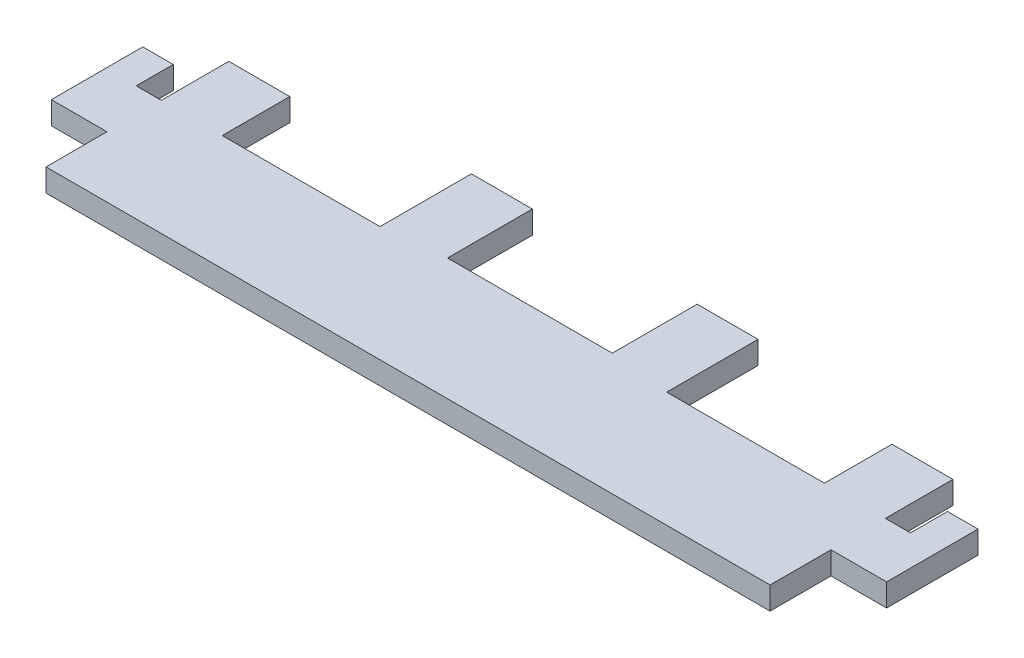
ISO-10303-21;
HEADER;
FILE_DESCRIPTION(('STEP AP214'),'2;1');
FILE_NAME('part.step','',(''),(''),'','','');
FILE_SCHEMA(('AUTOMOTIVE_DESIGN { 1 0 10303 214 1 1 1 1 }'));
ENDSEC;
DATA;
#1=APPLICATION_CONTEXT('core data for automotive mechanical design processes');
#2=APPLICATION_PROTOCOL_DEFINITION('international standard','automotive_design',2000,#1);
#3=PRODUCT_CONTEXT('',#1,'mechanical');
#4=PRODUCT('Part','Part','',(#3));
#5=PRODUCT_RELATED_PRODUCT_CATEGORY('part','',(#4));
#6=PRODUCT_DEFINITION_FORMATION('','',#4);
#7=PRODUCT_DEFINITION_CONTEXT('part definition',#1,'design');
#8=PRODUCT_DEFINITION('design','',#6,#7);
#9=PRODUCT_DEFINITION_SHAPE('','',#8);
#10=(LENGTH_UNIT() NAMED_UNIT(*) SI_UNIT(.MILLI.,.METRE.));
#11=(NAMED_UNIT(*) PLANE_ANGLE_UNIT() SI_UNIT($,.RADIAN.));
#12=(NAMED_UNIT(*) SI_UNIT($,.STERADIAN.) SOLID_ANGLE_UNIT());
#13=UNCERTAINTY_MEASURE_WITH_UNIT(LENGTH_MEASURE(1.E-05),#10,'distance_accuracy_value','');
#14=(GEOMETRIC_REPRESENTATION_CONTEXT(3) GLOBAL_UNCERTAINTY_ASSIGNED_CONTEXT((#13)) GLOBAL_UNIT_ASSIGNED_CONTEXT((#10,
#11,#12)) REPRESENTATION_CONTEXT('',''));
#15=CARTESIAN_POINT('',(0.,0.,0.));
#16=DIRECTION('',(0.,0.,1.));
#17=DIRECTION('',(1.,0.,0.));
#18=AXIS2_PLACEMENT_3D('',#15,#16,#17);
#19=CARTESIAN_POINT('',(-75.438,2.3622,-19.05));
#20=DIRECTION('',(1.,0.,0.));
#21=DIRECTION('',(0.,0.,-1.));
#22=AXIS2_PLACEMENT_3D('',#19,#20,#21);
#23=PLANE('',#22);
#24=DIRECTION('',(0.,0.,1.));
#25=VECTOR('',#24,1.);
#26=CARTESIAN_POINT('',(-75.438,0.,-19.05));
#27=LINE('',#26,#25);
#28=CARTESIAN_POINT('',(-75.438,0.,-19.05));
#29=VERTEX_POINT('',#28);
#30=CARTESIAN_POINT('',(-75.438,0.,-12.0142));
#31=VERTEX_POINT('',#30);
#32=EDGE_CURVE('E286',#29,#31,#27,.T.);
#33=ORIENTED_EDGE('',*,*,#32,.T.);
#34=DIRECTION('',(0.,-1.,0.));
#35=VECTOR('',#34,1.);
#36=CARTESIAN_POINT('',(-75.438,2.3622,-12.0142));
#37=LINE('',#36,#35);
#38=CARTESIAN_POINT('',(-75.438,2.3622,-12.0142));
#39=VERTEX_POINT('',#38);
#40=EDGE_CURVE('E408',#39,#31,#37,.T.);
#41=ORIENTED_EDGE('',*,*,#40,.F.);
#42=DIRECTION('',(0.,0.,1.));
#43=VECTOR('',#42,1.);
#44=CARTESIAN_POINT('',(-75.438,2.3622,-19.05));
#45=LINE('',#44,#43);
#46=CARTESIAN_POINT('',(-75.438,2.3622,-19.05));
#47=VERTEX_POINT('',#46);
#48=EDGE_CURVE('E341',#47,#39,#45,.T.);
#49=ORIENTED_EDGE('',*,*,#48,.F.);
#50=DIRECTION('',(0.,-1.,0.));
#51=VECTOR('',#50,1.);
#52=CARTESIAN_POINT('',(-75.438,2.3622,-19.05));
#53=LINE('',#52,#51);
#54=EDGE_CURVE('E285',#47,#29,#53,.T.);
#55=ORIENTED_EDGE('',*,*,#54,.T.);
#56=EDGE_LOOP('',(#33,#41,#49,#55));
#57=FACE_BOUND('',#56,.T.);
#58=ADVANCED_FACE('F34',(#57),#23,.F.);
#59=CARTESIAN_POINT('',(-75.438,2.3622,-12.0142));
#60=DIRECTION('',(0.,0.,1.));
#61=DIRECTION('',(1.,0.,0.));
#62=AXIS2_PLACEMENT_3D('',#59,#60,#61);
#63=PLANE('',#62);
#64=DIRECTION('',(-1.,0.,0.));
#65=VECTOR('',#64,1.);
#66=CARTESIAN_POINT('',(-75.438,0.,-12.0142));
#67=LINE('',#66,#65);
#68=CARTESIAN_POINT('',(-78.0542,0.,-12.0142));
#69=VERTEX_POINT('',#68);
#70=EDGE_CURVE('E289',#31,#69,#67,.T.);
#71=ORIENTED_EDGE('',*,*,#70,.T.);
#72=DIRECTION('',(0.,-1.,0.));
#73=VECTOR('',#72,1.);
#74=CARTESIAN_POINT('',(-78.0542,2.3622,-12.0142));
#75=LINE('',#74,#73);
#76=CARTESIAN_POINT('',(-78.0542,2.3622,-12.0142));
#77=VERTEX_POINT('',#76);
#78=EDGE_CURVE('E405',#77,#69,#75,.T.);
#79=ORIENTED_EDGE('',*,*,#78,.F.);
#80=DIRECTION('',(-1.,0.,0.));
#81=VECTOR('',#80,1.);
#82=CARTESIAN_POINT('',(-75.438,2.3622,-12.0142));
#83=LINE('',#82,#81);
#84=EDGE_CURVE('E239',#39,#77,#83,.T.);
#85=ORIENTED_EDGE('',*,*,#84,.F.);
#86=ORIENTED_EDGE('',*,*,#40,.T.);
#87=EDGE_LOOP('',(#71,#79,#85,#86));
#88=FACE_BOUND('',#87,.T.);
#89=ADVANCED_FACE('F447',(#88),#63,.F.);
#90=CARTESIAN_POINT('',(-78.0542,2.3622,-19.05));
#91=DIRECTION('',(-1.,0.,0.));
#92=DIRECTION('',(0.,0.,1.));
#93=AXIS2_PLACEMENT_3D('',#90,#91,#92);
#94=PLANE('',#93);
#95=DIRECTION('',(0.,0.,-1.));
#96=VECTOR('',#95,1.);
#97=CARTESIAN_POINT('',(-78.0542,0.,-19.05));
#98=LINE('',#97,#96);
#99=CARTESIAN_POINT('',(-78.0542,0.,-15.875));
#100=VERTEX_POINT('',#99);
#101=EDGE_CURVE('E291',#69,#100,#98,.T.);
#102=ORIENTED_EDGE('',*,*,#101,.T.);
#103=DIRECTION('',(0.,1.,0.));
#104=VECTOR('',#103,1.);
#105=CARTESIAN_POINT('',(-78.0542,-0.1778,-15.875));
#106=LINE('',#105,#104);
#107=CARTESIAN_POINT('',(-78.0542,2.3622,-15.875));
#108=VERTEX_POINT('',#107);
#109=EDGE_CURVE('E47',#100,#108,#106,.T.);
#110=ORIENTED_EDGE('',*,*,#109,.T.);
#111=DIRECTION('',(0.,0.,-1.));
#112=VECTOR('',#111,1.);
#113=CARTESIAN_POINT('',(-78.0542,2.3622,-19.05));
#114=LINE('',#113,#112);
#115=EDGE_CURVE('E229',#77,#108,#114,.T.);
#116=ORIENTED_EDGE('',*,*,#115,.F.);
#117=ORIENTED_EDGE('',*,*,#78,.T.);
#118=EDGE_LOOP('',(#102,#110,#116,#117));
#119=FACE_BOUND('',#118,.T.);
#120=ADVANCED_FACE('F450',(#119),#94,.F.);
#121=CARTESIAN_POINT('',(-81.2292,2.3622,-6.34999999999999));
#122=DIRECTION('',(1.,0.,0.));
#123=DIRECTION('',(0.,0.,-1.));
#124=AXIS2_PLACEMENT_3D('',#121,#122,#123);
#125=PLANE('',#124);
#126=DIRECTION('',(0.,0.,1.));
#127=VECTOR('',#126,1.);
#128=CARTESIAN_POINT('',(-81.2292,2.3622,-6.34999999999999));
#129=LINE('',#128,#127);
#130=CARTESIAN_POINT('',(-81.2292,2.3622,-15.875));
#131=VERTEX_POINT('',#130);
#132=CARTESIAN_POINT('',(-81.2292,2.3622,-6.34999999999999));
#133=VERTEX_POINT('',#132);
#134=EDGE_CURVE('E226',#131,#133,#129,.T.);
#135=ORIENTED_EDGE('',*,*,#134,.F.);
#136=DIRECTION('',(0.,1.,0.));
#137=VECTOR('',#136,1.);
#138=CARTESIAN_POINT('',(-81.2292,-0.1778,-15.875));
#139=LINE('',#138,#137);
#140=CARTESIAN_POINT('',(-81.2292,0.,-15.875));
#141=VERTEX_POINT('',#140);
#142=EDGE_CURVE('E215',#141,#131,#139,.T.);
#143=ORIENTED_EDGE('',*,*,#142,.F.);
#144=DIRECTION('',(0.,0.,1.));
#145=VECTOR('',#144,1.);
#146=CARTESIAN_POINT('',(-81.2292,0.,-6.34999999999999));
#147=LINE('',#146,#145);
#148=CARTESIAN_POINT('',(-81.2292,0.,-6.34999999999999));
#149=VERTEX_POINT('',#148);
#150=EDGE_CURVE('E294',#141,#149,#147,.T.);
#151=ORIENTED_EDGE('',*,*,#150,.T.);
#152=DIRECTION('',(0.,-1.,0.));
#153=VECTOR('',#152,1.);
#154=CARTESIAN_POINT('',(-81.2292,2.3622,-6.34999999999999));
#155=LINE('',#154,#153);
#156=EDGE_CURVE('E233',#133,#149,#155,.T.);
#157=ORIENTED_EDGE('',*,*,#156,.F.);
#158=EDGE_LOOP('',(#135,#143,#151,#157));
#159=FACE_BOUND('',#158,.T.);
#160=ADVANCED_FACE('F231',(#159),#125,.F.);
#161=CARTESIAN_POINT('',(-81.2292,2.3622,-6.34999999999999));
#162=DIRECTION('',(0.,0.,-1.));
#163=DIRECTION('',(-1.,0.,0.));
#164=AXIS2_PLACEMENT_3D('',#161,#162,#163);
#165=PLANE('',#164);
#166=DIRECTION('',(1.,0.,0.));
#167=VECTOR('',#166,1.);
#168=CARTESIAN_POINT('',(-81.2292,0.,-6.34999999999999));
#169=LINE('',#168,#167);
#170=CARTESIAN_POINT('',(-75.438,0.,-6.34999999999999));
#171=VERTEX_POINT('',#170);
#172=EDGE_CURVE('E296',#149,#171,#169,.T.);
#173=ORIENTED_EDGE('',*,*,#172,.T.);
#174=DIRECTION('',(0.,-1.,0.));
#175=VECTOR('',#174,1.);
#176=CARTESIAN_POINT('',(-75.438,2.3622,-6.34999999999999));
#177=LINE('',#176,#175);
#178=CARTESIAN_POINT('',(-75.438,2.3622,-6.34999999999999));
#179=VERTEX_POINT('',#178);
#180=EDGE_CURVE('E401',#179,#171,#177,.T.);
#181=ORIENTED_EDGE('',*,*,#180,.F.);
#182=DIRECTION('',(1.,0.,0.));
#183=VECTOR('',#182,1.);
#184=CARTESIAN_POINT('',(-81.2292,2.3622,-6.34999999999999));
#185=LINE('',#184,#183);
#186=EDGE_CURVE('E235',#133,#179,#185,.T.);
#187=ORIENTED_EDGE('',*,*,#186,.F.);
#188=ORIENTED_EDGE('',*,*,#156,.T.);
#189=EDGE_LOOP('',(#173,#181,#187,#188));
#190=FACE_BOUND('',#189,.T.);
#191=ADVANCED_FACE('F455',(#190),#165,.F.);
#192=CARTESIAN_POINT('',(-75.438,2.3622,-6.34999999999999));
#193=DIRECTION('',(1.,0.,0.));
#194=DIRECTION('',(0.,0.,-1.));
#195=AXIS2_PLACEMENT_3D('',#192,#193,#194);
#196=PLANE('',#195);
#197=DIRECTION('',(0.,0.,1.));
#198=VECTOR('',#197,1.);
#199=CARTESIAN_POINT('',(-75.438,0.,-6.34999999999999));
#200=LINE('',#199,#198);
#201=CARTESIAN_POINT('',(-75.438,0.,0.));
#202=VERTEX_POINT('',#201);
#203=EDGE_CURVE('E298',#171,#202,#200,.T.);
#204=ORIENTED_EDGE('',*,*,#203,.T.);
#205=DIRECTION('',(0.,-1.,0.));
#206=VECTOR('',#205,1.);
#207=CARTESIAN_POINT('',(-75.438,2.3622,0.));
#208=LINE('',#207,#206);
#209=CARTESIAN_POINT('',(-75.438,2.3622,0.));
#210=VERTEX_POINT('',#209);
#211=EDGE_CURVE('E398',#210,#202,#208,.T.);
#212=ORIENTED_EDGE('',*,*,#211,.F.);
#213=DIRECTION('',(0.,0.,1.));
#214=VECTOR('',#213,1.);
#215=CARTESIAN_POINT('',(-75.438,2.3622,-6.34999999999999));
#216=LINE('',#215,#214);
#217=EDGE_CURVE('E237',#179,#210,#216,.T.);
#218=ORIENTED_EDGE('',*,*,#217,.F.);
#219=ORIENTED_EDGE('',*,*,#180,.T.);
#220=EDGE_LOOP('',(#204,#212,#218,#219));
#221=FACE_BOUND('',#220,.T.);
#222=ADVANCED_FACE('F462',(#221),#196,.F.);
#223=CARTESIAN_POINT('',(0.,2.3622,0.));
#224=DIRECTION('',(0.,0.,-1.));
#225=DIRECTION('',(-1.,0.,0.));
#226=AXIS2_PLACEMENT_3D('',#223,#224,#225);
#227=PLANE('',#226);
#228=DIRECTION('',(1.,0.,0.));
#229=VECTOR('',#228,1.);
#230=CARTESIAN_POINT('',(0.,0.,0.));
#231=LINE('',#230,#229);
#232=CARTESIAN_POINT('',(0.,0.,0.));
#233=VERTEX_POINT('',#232);
#234=EDGE_CURVE('E300',#202,#233,#231,.T.);
#235=ORIENTED_EDGE('',*,*,#234,.T.);
#236=DIRECTION('',(0.,-1.,0.));
#237=VECTOR('',#236,1.);
#238=CARTESIAN_POINT('',(0.,2.3622,0.));
#239=LINE('',#238,#237);
#240=CARTESIAN_POINT('',(0.,2.3622,0.));
#241=VERTEX_POINT('',#240);
#242=EDGE_CURVE('E395',#241,#233,#239,.T.);
#243=ORIENTED_EDGE('',*,*,#242,.F.);
#244=DIRECTION('',(1.,0.,0.));
#245=VECTOR('',#244,1.);
#246=CARTESIAN_POINT('',(0.,2.3622,0.));
#247=LINE('',#246,#245);
#248=EDGE_CURVE('E244',#210,#241,#247,.T.);
#249=ORIENTED_EDGE('',*,*,#248,.F.);
#250=ORIENTED_EDGE('',*,*,#211,.T.);
#251=EDGE_LOOP('',(#235,#243,#249,#250));
#252=FACE_BOUND('',#251,.T.);
#253=ADVANCED_FACE('F465',(#252),#227,.F.);
#254=CARTESIAN_POINT('',(0.,2.3622,-6.35));
#255=DIRECTION('',(-1.,0.,0.));
#256=DIRECTION('',(0.,0.,1.));
#257=AXIS2_PLACEMENT_3D('',#254,#255,#256);
#258=PLANE('',#257);
#259=DIRECTION('',(0.,0.,-1.));
#260=VECTOR('',#259,1.);
#261=CARTESIAN_POINT('',(0.,0.,-6.35));
#262=LINE('',#261,#260);
#263=CARTESIAN_POINT('',(0.,0.,-6.35));
#264=VERTEX_POINT('',#263);
#265=EDGE_CURVE('E302',#233,#264,#262,.T.);
#266=ORIENTED_EDGE('',*,*,#265,.T.);
#267=DIRECTION('',(0.,-1.,0.));
#268=VECTOR('',#267,1.);
#269=CARTESIAN_POINT('',(0.,2.3622,-6.35));
#270=LINE('',#269,#268);
#271=CARTESIAN_POINT('',(0.,2.3622,-6.35));
#272=VERTEX_POINT('',#271);
#273=EDGE_CURVE('E392',#272,#264,#270,.T.);
#274=ORIENTED_EDGE('',*,*,#273,.F.);
#275=DIRECTION('',(0.,0.,-1.));
#276=VECTOR('',#275,1.);
#277=CARTESIAN_POINT('',(0.,2.3622,-6.35));
#278=LINE('',#277,#276);
#279=EDGE_CURVE('E246',#241,#272,#278,.T.);
#280=ORIENTED_EDGE('',*,*,#279,.F.);
#281=ORIENTED_EDGE('',*,*,#242,.T.);
#282=EDGE_LOOP('',(#266,#274,#280,#281));
#283=FACE_BOUND('',#282,.T.);
#284=ADVANCED_FACE('F470',(#283),#258,.F.);
#285=CARTESIAN_POINT('',(5.7912,2.3622,-6.34999999999999));
#286=DIRECTION('',(0.,0.,-1.));
#287=DIRECTION('',(-1.,0.,0.));
#288=AXIS2_PLACEMENT_3D('',#285,#286,#287);
#289=PLANE('',#288);
#290=DIRECTION('',(1.,0.,0.));
#291=VECTOR('',#290,1.);
#292=CARTESIAN_POINT('',(5.7912,0.,-6.34999999999999));
#293=LINE('',#292,#291);
#294=CARTESIAN_POINT('',(5.7912,0.,-6.34999999999999));
#295=VERTEX_POINT('',#294);
#296=EDGE_CURVE('E304',#264,#295,#293,.T.);
#297=ORIENTED_EDGE('',*,*,#296,.T.);
#298=DIRECTION('',(0.,-1.,0.));
#299=VECTOR('',#298,1.);
#300=CARTESIAN_POINT('',(5.7912,2.3622,-6.34999999999999));
#301=LINE('',#300,#299);
#302=CARTESIAN_POINT('',(5.7912,2.3622,-6.34999999999999));
#303=VERTEX_POINT('',#302);
#304=EDGE_CURVE('E389',#303,#295,#301,.T.);
#305=ORIENTED_EDGE('',*,*,#304,.F.);
#306=DIRECTION('',(1.,0.,0.));
#307=VECTOR('',#306,1.);
#308=CARTESIAN_POINT('',(5.7912,2.3622,-6.34999999999999));
#309=LINE('',#308,#307);
#310=EDGE_CURVE('E248',#272,#303,#309,.T.);
#311=ORIENTED_EDGE('',*,*,#310,.F.);
#312=ORIENTED_EDGE('',*,*,#273,.T.);
#313=EDGE_LOOP('',(#297,#305,#311,#312));
#314=FACE_BOUND('',#313,.T.);
#315=ADVANCED_FACE('F474',(#314),#289,.F.);
#316=CARTESIAN_POINT('',(5.7912,2.3622,-6.34999999999999));
#317=DIRECTION('',(-1.,0.,0.));
#318=DIRECTION('',(0.,0.,1.));
#319=AXIS2_PLACEMENT_3D('',#316,#317,#318);
#320=PLANE('',#319);
#321=DIRECTION('',(0.,0.,-1.));
#322=VECTOR('',#321,1.);
#323=CARTESIAN_POINT('',(5.7912,0.,-6.34999999999999));
#324=LINE('',#323,#322);
#325=CARTESIAN_POINT('',(5.7912,0.,-15.875));
#326=VERTEX_POINT('',#325);
#327=EDGE_CURVE('E306',#295,#326,#324,.T.);
#328=ORIENTED_EDGE('',*,*,#327,.T.);
#329=DIRECTION('',(0.,1.,0.));
#330=VECTOR('',#329,1.);
#331=CARTESIAN_POINT('',(5.7912,-0.1778,-15.875));
#332=LINE('',#331,#330);
#333=CARTESIAN_POINT('',(5.7912,2.3622,-15.875));
#334=VERTEX_POINT('',#333);
#335=EDGE_CURVE('E55',#326,#334,#332,.T.);
#336=ORIENTED_EDGE('',*,*,#335,.T.);
#337=DIRECTION('',(0.,0.,-1.));
#338=VECTOR('',#337,1.);
#339=CARTESIAN_POINT('',(5.7912,2.3622,-6.34999999999999));
#340=LINE('',#339,#338);
#341=EDGE_CURVE('E250',#303,#334,#340,.T.);
#342=ORIENTED_EDGE('',*,*,#341,.F.);
#343=ORIENTED_EDGE('',*,*,#304,.T.);
#344=EDGE_LOOP('',(#328,#336,#342,#343));
#345=FACE_BOUND('',#344,.T.);
#346=ADVANCED_FACE('F477',(#345),#320,.F.);
#347=CARTESIAN_POINT('',(2.6162,2.3622,-19.05));
#348=DIRECTION('',(1.,0.,0.));
#349=DIRECTION('',(0.,0.,-1.));
#350=AXIS2_PLACEMENT_3D('',#347,#348,#349);
#351=PLANE('',#350);
#352=DIRECTION('',(0.,0.,1.));
#353=VECTOR('',#352,1.);
#354=CARTESIAN_POINT('',(2.6162,2.3622,-19.05));
#355=LINE('',#354,#353);
#356=CARTESIAN_POINT('',(2.6162,2.3622,-15.875));
#357=VERTEX_POINT('',#356);
#358=CARTESIAN_POINT('',(2.6162,2.3622,-12.0142));
#359=VERTEX_POINT('',#358);
#360=EDGE_CURVE('E253',#357,#359,#355,.T.);
#361=ORIENTED_EDGE('',*,*,#360,.F.);
#362=DIRECTION('',(0.,1.,0.));
#363=VECTOR('',#362,1.);
#364=CARTESIAN_POINT('',(2.6162,-0.1778,-15.875));
#365=LINE('',#364,#363);
#366=CARTESIAN_POINT('',(2.6162,0.,-15.875));
#367=VERTEX_POINT('',#366);
#368=EDGE_CURVE('E412',#367,#357,#365,.T.);
#369=ORIENTED_EDGE('',*,*,#368,.F.);
#370=DIRECTION('',(0.,0.,1.));
#371=VECTOR('',#370,1.);
#372=CARTESIAN_POINT('',(2.6162,0.,-19.05));
#373=LINE('',#372,#371);
#374=CARTESIAN_POINT('',(2.6162,0.,-12.0142));
#375=VERTEX_POINT('',#374);
#376=EDGE_CURVE('E309',#367,#375,#373,.T.);
#377=ORIENTED_EDGE('',*,*,#376,.T.);
#378=DIRECTION('',(0.,-1.,0.));
#379=VECTOR('',#378,1.);
#380=CARTESIAN_POINT('',(2.6162,2.3622,-12.0142));
#381=LINE('',#380,#379);
#382=EDGE_CURVE('E386',#359,#375,#381,.T.);
#383=ORIENTED_EDGE('',*,*,#382,.F.);
#384=EDGE_LOOP('',(#361,#369,#377,#383));
#385=FACE_BOUND('',#384,.T.);
#386=ADVANCED_FACE('F419',(#385),#351,.F.);
#387=CARTESIAN_POINT('',(0.,2.3622,-12.0142));
#388=DIRECTION('',(0.,0.,1.));
#389=DIRECTION('',(1.,0.,0.));
#390=AXIS2_PLACEMENT_3D('',#387,#388,#389);
#391=PLANE('',#390);
#392=DIRECTION('',(-1.,0.,0.));
#393=VECTOR('',#392,1.);
#394=CARTESIAN_POINT('',(0.,0.,-12.0142));
#395=LINE('',#394,#393);
#396=CARTESIAN_POINT('',(0.,0.,-12.0142));
#397=VERTEX_POINT('',#396);
#398=EDGE_CURVE('E311',#375,#397,#395,.T.);
#399=ORIENTED_EDGE('',*,*,#398,.T.);
#400=DIRECTION('',(0.,-1.,0.));
#401=VECTOR('',#400,1.);
#402=CARTESIAN_POINT('',(0.,2.3622,-12.0142));
#403=LINE('',#402,#401);
#404=CARTESIAN_POINT('',(0.,2.3622,-12.0142));
#405=VERTEX_POINT('',#404);
#406=EDGE_CURVE('E383',#405,#397,#403,.T.);
#407=ORIENTED_EDGE('',*,*,#406,.F.);
#408=DIRECTION('',(-1.,0.,0.));
#409=VECTOR('',#408,1.);
#410=CARTESIAN_POINT('',(0.,2.3622,-12.0142));
#411=LINE('',#410,#409);
#412=EDGE_CURVE('E255',#359,#405,#411,.T.);
#413=ORIENTED_EDGE('',*,*,#412,.F.);
#414=ORIENTED_EDGE('',*,*,#382,.T.);
#415=EDGE_LOOP('',(#399,#407,#413,#414));
#416=FACE_BOUND('',#415,.T.);
#417=ADVANCED_FACE('F429',(#416),#391,.F.);
#418=CARTESIAN_POINT('',(0.,2.3622,-19.05));
#419=DIRECTION('',(-1.,0.,0.));
#420=DIRECTION('',(0.,0.,1.));
#421=AXIS2_PLACEMENT_3D('',#418,#419,#420);
#422=PLANE('',#421);
#423=DIRECTION('',(0.,0.,-1.));
#424=VECTOR('',#423,1.);
#425=CARTESIAN_POINT('',(0.,0.,-19.05));
#426=LINE('',#425,#424);
#427=CARTESIAN_POINT('',(0.,0.,-19.05));
#428=VERTEX_POINT('',#427);
#429=EDGE_CURVE('E313',#397,#428,#426,.T.);
#430=ORIENTED_EDGE('',*,*,#429,.T.);
#431=DIRECTION('',(0.,-1.,0.));
#432=VECTOR('',#431,1.);
#433=CARTESIAN_POINT('',(0.,2.3622,-19.05));
#434=LINE('',#433,#432);
#435=CARTESIAN_POINT('',(0.,2.3622,-19.05));
#436=VERTEX_POINT('',#435);
#437=EDGE_CURVE('E380',#436,#428,#434,.T.);
#438=ORIENTED_EDGE('',*,*,#437,.F.);
#439=DIRECTION('',(0.,0.,-1.));
#440=VECTOR('',#439,1.);
#441=CARTESIAN_POINT('',(0.,2.3622,-19.05));
#442=LINE('',#441,#440);
#443=EDGE_CURVE('E257',#405,#436,#442,.T.);
#444=ORIENTED_EDGE('',*,*,#443,.F.);
#445=ORIENTED_EDGE('',*,*,#406,.T.);
#446=EDGE_LOOP('',(#430,#438,#444,#445));
#447=FACE_BOUND('',#446,.T.);
#448=ADVANCED_FACE('F433',(#447),#422,.F.);
#449=CARTESIAN_POINT('',(-6.35,2.3622,-19.05));
#450=DIRECTION('',(0.,0.,1.));
#451=DIRECTION('',(1.,0.,0.));
#452=AXIS2_PLACEMENT_3D('',#449,#450,#451);
#453=PLANE('',#452);
#454=DIRECTION('',(-1.,0.,0.));
#455=VECTOR('',#454,1.);
#456=CARTESIAN_POINT('',(-6.35,0.,-19.05));
#457=LINE('',#456,#455);
#458=CARTESIAN_POINT('',(-6.35,0.,-19.05));
#459=VERTEX_POINT('',#458);
#460=EDGE_CURVE('E315',#428,#459,#457,.T.);
#461=ORIENTED_EDGE('',*,*,#460,.T.);
#462=DIRECTION('',(0.,-1.,0.));
#463=VECTOR('',#462,1.);
#464=CARTESIAN_POINT('',(-6.35,2.3622,-19.05));
#465=LINE('',#464,#463);
#466=CARTESIAN_POINT('',(-6.35,2.3622,-19.05));
#467=VERTEX_POINT('',#466);
#468=EDGE_CURVE('E377',#467,#459,#465,.T.);
#469=ORIENTED_EDGE('',*,*,#468,.F.);
#470=DIRECTION('',(-1.,0.,0.));
#471=VECTOR('',#470,1.);
#472=CARTESIAN_POINT('',(-6.35,2.3622,-19.05));
#473=LINE('',#472,#471);
#474=EDGE_CURVE('E259',#436,#467,#473,.T.);
#475=ORIENTED_EDGE('',*,*,#474,.F.);
#476=ORIENTED_EDGE('',*,*,#437,.T.);
#477=EDGE_LOOP('',(#461,#469,#475,#476));
#478=FACE_BOUND('',#477,.T.);
#479=ADVANCED_FACE('F553',(#478),#453,.F.);
#480=CARTESIAN_POINT('',(-6.35,2.3622,-12.0142));
#481=DIRECTION('',(1.,0.,0.));
#482=DIRECTION('',(0.,0.,-1.));
#483=AXIS2_PLACEMENT_3D('',#480,#481,#482);
#484=PLANE('',#483);
#485=DIRECTION('',(0.,0.,1.));
#486=VECTOR('',#485,1.);
#487=CARTESIAN_POINT('',(-6.35,0.,-12.0142));
#488=LINE('',#487,#486);
#489=CARTESIAN_POINT('',(-6.35,0.,-12.0142));
#490=VERTEX_POINT('',#489);
#491=EDGE_CURVE('E317',#459,#490,#488,.T.);
#492=ORIENTED_EDGE('',*,*,#491,.T.);
#493=DIRECTION('',(0.,-1.,0.));
#494=VECTOR('',#493,1.);
#495=CARTESIAN_POINT('',(-6.35,2.3622,-12.0142));
#496=LINE('',#495,#494);
#497=CARTESIAN_POINT('',(-6.35,2.3622,-12.0142));
#498=VERTEX_POINT('',#497);
#499=EDGE_CURVE('E374',#498,#490,#496,.T.);
#500=ORIENTED_EDGE('',*,*,#499,.F.);
#501=DIRECTION('',(0.,0.,1.));
#502=VECTOR('',#501,1.);
#503=CARTESIAN_POINT('',(-6.35,2.3622,-12.0142));
#504=LINE('',#503,#502);
#505=EDGE_CURVE('E261',#467,#498,#504,.T.);
#506=ORIENTED_EDGE('',*,*,#505,.F.);
#507=ORIENTED_EDGE('',*,*,#468,.T.);
#508=EDGE_LOOP('',(#492,#500,#506,#507));
#509=FACE_BOUND('',#508,.T.);
#510=ADVANCED_FACE('F551',(#509),#484,.F.);
#511=CARTESIAN_POINT('',(-22.7838,2.3622,-12.0142));
#512=DIRECTION('',(0.,0.,1.));
#513=DIRECTION('',(1.,0.,0.));
#514=AXIS2_PLACEMENT_3D('',#511,#512,#513);
#515=PLANE('',#514);
#516=DIRECTION('',(-1.,0.,0.));
#517=VECTOR('',#516,1.);
#518=CARTESIAN_POINT('',(-22.7838,0.,-12.0142));
#519=LINE('',#518,#517);
#520=CARTESIAN_POINT('',(-22.7838,0.,-12.0142));
#521=VERTEX_POINT('',#520);
#522=EDGE_CURVE('E319',#490,#521,#519,.T.);
#523=ORIENTED_EDGE('',*,*,#522,.T.);
#524=DIRECTION('',(0.,-1.,0.));
#525=VECTOR('',#524,1.);
#526=CARTESIAN_POINT('',(-22.7838,2.3622,-12.0142));
#527=LINE('',#526,#525);
#528=CARTESIAN_POINT('',(-22.7838,2.3622,-12.0142));
#529=VERTEX_POINT('',#528);
#530=EDGE_CURVE('E371',#529,#521,#527,.T.);
#531=ORIENTED_EDGE('',*,*,#530,.F.);
#532=DIRECTION('',(-1.,0.,0.));
#533=VECTOR('',#532,1.);
#534=CARTESIAN_POINT('',(-22.7838,2.3622,-12.0142));
#535=LINE('',#534,#533);
#536=EDGE_CURVE('E263',#498,#529,#535,.T.);
#537=ORIENTED_EDGE('',*,*,#536,.F.);
#538=ORIENTED_EDGE('',*,*,#499,.T.);
#539=EDGE_LOOP('',(#523,#531,#537,#538));
#540=FACE_BOUND('',#539,.T.);
#541=ADVANCED_FACE('F547',(#540),#515,.F.);
#542=CARTESIAN_POINT('',(-22.7838,2.3622,-12.0142));
#543=DIRECTION('',(-1.,0.,0.));
#544=DIRECTION('',(0.,0.,1.));
#545=AXIS2_PLACEMENT_3D('',#542,#543,#544);
#546=PLANE('',#545);
#547=DIRECTION('',(0.,0.,-1.));
#548=VECTOR('',#547,1.);
#549=CARTESIAN_POINT('',(-22.7838,0.,-12.0142));
#550=LINE('',#549,#548);
#551=CARTESIAN_POINT('',(-22.7838,0.,-21.5392));
#552=VERTEX_POINT('',#551);
#553=EDGE_CURVE('E321',#521,#552,#550,.T.);
#554=ORIENTED_EDGE('',*,*,#553,.T.);
#555=DIRECTION('',(0.,-1.,0.));
#556=VECTOR('',#555,1.);
#557=CARTESIAN_POINT('',(-22.7838,2.3622,-21.5392));
#558=LINE('',#557,#556);
#559=CARTESIAN_POINT('',(-22.7838,2.3622,-21.5392));
#560=VERTEX_POINT('',#559);
#561=EDGE_CURVE('E368',#560,#552,#558,.T.);
#562=ORIENTED_EDGE('',*,*,#561,.F.);
#563=DIRECTION('',(0.,0.,-1.));
#564=VECTOR('',#563,1.);
#565=CARTESIAN_POINT('',(-22.7838,2.3622,-12.0142));
#566=LINE('',#565,#564);
#567=EDGE_CURVE('E265',#529,#560,#566,.T.);
#568=ORIENTED_EDGE('',*,*,#567,.F.);
#569=ORIENTED_EDGE('',*,*,#530,.T.);
#570=EDGE_LOOP('',(#554,#562,#568,#569));
#571=FACE_BOUND('',#570,.T.);
#572=ADVANCED_FACE('F542',(#571),#546,.F.);
#573=CARTESIAN_POINT('',(-22.7838,2.3622,-21.5392));
#574=DIRECTION('',(0.,0.,1.));
#575=DIRECTION('',(1.,0.,0.));
#576=AXIS2_PLACEMENT_3D('',#573,#574,#575);
#577=PLANE('',#576);
#578=DIRECTION('',(-1.,0.,0.));
#579=VECTOR('',#578,1.);
#580=CARTESIAN_POINT('',(-22.7838,0.,-21.5392));
#581=LINE('',#580,#579);
#582=CARTESIAN_POINT('',(-29.1338,0.,-21.5392));
#583=VERTEX_POINT('',#582);
#584=EDGE_CURVE('E323',#552,#583,#581,.T.);
#585=ORIENTED_EDGE('',*,*,#584,.T.);
#586=DIRECTION('',(0.,-1.,0.));
#587=VECTOR('',#586,1.);
#588=CARTESIAN_POINT('',(-29.1338,2.3622,-21.5392));
#589=LINE('',#588,#587);
#590=CARTESIAN_POINT('',(-29.1338,2.3622,-21.5392));
#591=VERTEX_POINT('',#590);
#592=EDGE_CURVE('E365',#591,#583,#589,.T.);
#593=ORIENTED_EDGE('',*,*,#592,.F.);
#594=DIRECTION('',(-1.,0.,0.));
#595=VECTOR('',#594,1.);
#596=CARTESIAN_POINT('',(-22.7838,2.3622,-21.5392));
#597=LINE('',#596,#595);
#598=EDGE_CURVE('E267',#560,#591,#597,.T.);
#599=ORIENTED_EDGE('',*,*,#598,.F.);
#600=ORIENTED_EDGE('',*,*,#561,.T.);
#601=EDGE_LOOP('',(#585,#593,#599,#600));
#602=FACE_BOUND('',#601,.T.);
#603=ADVANCED_FACE('F536',(#602),#577,.F.);
#604=CARTESIAN_POINT('',(-29.1338,2.3622,-21.5392));
#605=DIRECTION('',(1.,0.,0.));
#606=DIRECTION('',(0.,0.,-1.));
#607=AXIS2_PLACEMENT_3D('',#604,#605,#606);
#608=PLANE('',#607);
#609=DIRECTION('',(0.,0.,1.));
#610=VECTOR('',#609,1.);
#611=CARTESIAN_POINT('',(-29.1338,0.,-21.5392));
#612=LINE('',#611,#610);
#613=CARTESIAN_POINT('',(-29.1338,0.,-12.7));
#614=VERTEX_POINT('',#613);
#615=EDGE_CURVE('E325',#583,#614,#612,.T.);
#616=ORIENTED_EDGE('',*,*,#615,.T.);
#617=DIRECTION('',(0.,-1.,0.));
#618=VECTOR('',#617,1.);
#619=CARTESIAN_POINT('',(-29.1338,2.3622,-12.7));
#620=LINE('',#619,#618);
#621=CARTESIAN_POINT('',(-29.1338,2.3622,-12.7));
#622=VERTEX_POINT('',#621);
#623=EDGE_CURVE('E362',#622,#614,#620,.T.);
#624=ORIENTED_EDGE('',*,*,#623,.F.);
#625=DIRECTION('',(0.,0.,1.));
#626=VECTOR('',#625,1.);
#627=CARTESIAN_POINT('',(-29.1338,2.3622,-21.5392));
#628=LINE('',#627,#626);
#629=EDGE_CURVE('E269',#591,#622,#628,.T.);
#630=ORIENTED_EDGE('',*,*,#629,.F.);
#631=ORIENTED_EDGE('',*,*,#592,.T.);
#632=EDGE_LOOP('',(#616,#624,#630,#631));
#633=FACE_BOUND('',#632,.T.);
#634=ADVANCED_FACE('F532',(#633),#608,.F.);
#635=CARTESIAN_POINT('',(-29.1338,2.3622,-12.7));
#636=DIRECTION('',(0.,0.,1.));
#637=DIRECTION('',(1.,0.,0.));
#638=AXIS2_PLACEMENT_3D('',#635,#636,#637);
#639=PLANE('',#638);
#640=DIRECTION('',(-1.,0.,0.));
#641=VECTOR('',#640,1.);
#642=CARTESIAN_POINT('',(-29.1338,0.,-12.7));
#643=LINE('',#642,#641);
#644=CARTESIAN_POINT('',(-46.3042,0.,-12.7));
#645=VERTEX_POINT('',#644);
#646=EDGE_CURVE('E327',#614,#645,#643,.T.);
#647=ORIENTED_EDGE('',*,*,#646,.T.);
#648=DIRECTION('',(0.,-1.,0.));
#649=VECTOR('',#648,1.);
#650=CARTESIAN_POINT('',(-46.3042,2.3622,-12.7));
#651=LINE('',#650,#649);
#652=CARTESIAN_POINT('',(-46.3042,2.3622,-12.7));
#653=VERTEX_POINT('',#652);
#654=EDGE_CURVE('E359',#653,#645,#651,.T.);
#655=ORIENTED_EDGE('',*,*,#654,.F.);
#656=DIRECTION('',(-1.,0.,0.));
#657=VECTOR('',#656,1.);
#658=CARTESIAN_POINT('',(-29.1338,2.3622,-12.7));
#659=LINE('',#658,#657);
#660=EDGE_CURVE('E271',#622,#653,#659,.T.);
#661=ORIENTED_EDGE('',*,*,#660,.F.);
#662=ORIENTED_EDGE('',*,*,#623,.T.);
#663=EDGE_LOOP('',(#647,#655,#661,#662));
#664=FACE_BOUND('',#663,.T.);
#665=ADVANCED_FACE('F527',(#664),#639,.F.);
#666=CARTESIAN_POINT('',(-46.3042,2.3622,-21.5392));
#667=DIRECTION('',(-1.,0.,0.));
#668=DIRECTION('',(0.,0.,1.));
#669=AXIS2_PLACEMENT_3D('',#666,#667,#668);
#670=PLANE('',#669);
#671=DIRECTION('',(0.,0.,-1.));
#672=VECTOR('',#671,1.);
#673=CARTESIAN_POINT('',(-46.3042,0.,-21.5392));
#674=LINE('',#673,#672);
#675=CARTESIAN_POINT('',(-46.3042,0.,-21.5392));
#676=VERTEX_POINT('',#675);
#677=EDGE_CURVE('E329',#645,#676,#674,.T.);
#678=ORIENTED_EDGE('',*,*,#677,.T.);
#679=DIRECTION('',(0.,-1.,0.));
#680=VECTOR('',#679,1.);
#681=CARTESIAN_POINT('',(-46.3042,2.3622,-21.5392));
#682=LINE('',#681,#680);
#683=CARTESIAN_POINT('',(-46.3042,2.3622,-21.5392));
#684=VERTEX_POINT('',#683);
#685=EDGE_CURVE('E356',#684,#676,#682,.T.);
#686=ORIENTED_EDGE('',*,*,#685,.F.);
#687=DIRECTION('',(0.,0.,-1.));
#688=VECTOR('',#687,1.);
#689=CARTESIAN_POINT('',(-46.3042,2.3622,-21.5392));
#690=LINE('',#689,#688);
#691=EDGE_CURVE('E273',#653,#684,#690,.T.);
#692=ORIENTED_EDGE('',*,*,#691,.F.);
#693=ORIENTED_EDGE('',*,*,#654,.T.);
#694=EDGE_LOOP('',(#678,#686,#692,#693));
#695=FACE_BOUND('',#694,.T.);
#696=ADVANCED_FACE('F521',(#695),#670,.F.);
#697=CARTESIAN_POINT('',(-52.6542,2.3622,-21.5392));
#698=DIRECTION('',(0.,0.,1.));
#699=DIRECTION('',(1.,0.,0.));
#700=AXIS2_PLACEMENT_3D('',#697,#698,#699);
#701=PLANE('',#700);
#702=DIRECTION('',(-1.,0.,0.));
#703=VECTOR('',#702,1.);
#704=CARTESIAN_POINT('',(-52.6542,0.,-21.5392));
#705=LINE('',#704,#703);
#706=CARTESIAN_POINT('',(-52.6542,0.,-21.5392));
#707=VERTEX_POINT('',#706);
#708=EDGE_CURVE('E331',#676,#707,#705,.T.);
#709=ORIENTED_EDGE('',*,*,#708,.T.);
#710=DIRECTION('',(0.,-1.,0.));
#711=VECTOR('',#710,1.);
#712=CARTESIAN_POINT('',(-52.6542,2.3622,-21.5392));
#713=LINE('',#712,#711);
#714=CARTESIAN_POINT('',(-52.6542,2.3622,-21.5392));
#715=VERTEX_POINT('',#714);
#716=EDGE_CURVE('E353',#715,#707,#713,.T.);
#717=ORIENTED_EDGE('',*,*,#716,.F.);
#718=DIRECTION('',(-1.,0.,0.));
#719=VECTOR('',#718,1.);
#720=CARTESIAN_POINT('',(-52.6542,2.3622,-21.5392));
#721=LINE('',#720,#719);
#722=EDGE_CURVE('E275',#684,#715,#721,.T.);
#723=ORIENTED_EDGE('',*,*,#722,.F.);
#724=ORIENTED_EDGE('',*,*,#685,.T.);
#725=EDGE_LOOP('',(#709,#717,#723,#724));
#726=FACE_BOUND('',#725,.T.);
#727=ADVANCED_FACE('F517',(#726),#701,.F.);
#728=CARTESIAN_POINT('',(-52.6542,2.3622,-12.0142));
#729=DIRECTION('',(1.,0.,0.));
#730=DIRECTION('',(0.,0.,-1.));
#731=AXIS2_PLACEMENT_3D('',#728,#729,#730);
#732=PLANE('',#731);
#733=DIRECTION('',(0.,0.,1.));
#734=VECTOR('',#733,1.);
#735=CARTESIAN_POINT('',(-52.6542,0.,-12.0142));
#736=LINE('',#735,#734);
#737=CARTESIAN_POINT('',(-52.6542,0.,-12.0142));
#738=VERTEX_POINT('',#737);
#739=EDGE_CURVE('E333',#707,#738,#736,.T.);
#740=ORIENTED_EDGE('',*,*,#739,.T.);
#741=DIRECTION('',(0.,-1.,0.));
#742=VECTOR('',#741,1.);
#743=CARTESIAN_POINT('',(-52.6542,2.3622,-12.0142));
#744=LINE('',#743,#742);
#745=CARTESIAN_POINT('',(-52.6542,2.3622,-12.0142));
#746=VERTEX_POINT('',#745);
#747=EDGE_CURVE('E350',#746,#738,#744,.T.);
#748=ORIENTED_EDGE('',*,*,#747,.F.);
#749=DIRECTION('',(0.,0.,1.));
#750=VECTOR('',#749,1.);
#751=CARTESIAN_POINT('',(-52.6542,2.3622,-12.0142));
#752=LINE('',#751,#750);
#753=EDGE_CURVE('E277',#715,#746,#752,.T.);
#754=ORIENTED_EDGE('',*,*,#753,.F.);
#755=ORIENTED_EDGE('',*,*,#716,.T.);
#756=EDGE_LOOP('',(#740,#748,#754,#755));
#757=FACE_BOUND('',#756,.T.);
#758=ADVANCED_FACE('F512',(#757),#732,.F.);
#759=CARTESIAN_POINT('',(-52.6542,2.3622,-12.0142));
#760=DIRECTION('',(0.,0.,1.));
#761=DIRECTION('',(1.,0.,0.));
#762=AXIS2_PLACEMENT_3D('',#759,#760,#761);
#763=PLANE('',#762);
#764=DIRECTION('',(-1.,0.,0.));
#765=VECTOR('',#764,1.);
#766=CARTESIAN_POINT('',(-52.6542,0.,-12.0142));
#767=LINE('',#766,#765);
#768=CARTESIAN_POINT('',(-69.088,0.,-12.0142));
#769=VERTEX_POINT('',#768);
#770=EDGE_CURVE('E335',#738,#769,#767,.T.);
#771=ORIENTED_EDGE('',*,*,#770,.T.);
#772=DIRECTION('',(0.,-1.,0.));
#773=VECTOR('',#772,1.);
#774=CARTESIAN_POINT('',(-69.088,2.3622,-12.0142));
#775=LINE('',#774,#773);
#776=CARTESIAN_POINT('',(-69.088,2.3622,-12.0142));
#777=VERTEX_POINT('',#776);
#778=EDGE_CURVE('E347',#777,#769,#775,.T.);
#779=ORIENTED_EDGE('',*,*,#778,.F.);
#780=DIRECTION('',(-1.,0.,0.));
#781=VECTOR('',#780,1.);
#782=CARTESIAN_POINT('',(-52.6542,2.3622,-12.0142));
#783=LINE('',#782,#781);
#784=EDGE_CURVE('E279',#746,#777,#783,.T.);
#785=ORIENTED_EDGE('',*,*,#784,.F.);
#786=ORIENTED_EDGE('',*,*,#747,.T.);
#787=EDGE_LOOP('',(#771,#779,#785,#786));
#788=FACE_BOUND('',#787,.T.);
#789=ADVANCED_FACE('F506',(#788),#763,.F.);
#790=CARTESIAN_POINT('',(-69.088,2.3622,-12.0142));
#791=DIRECTION('',(-1.,0.,0.));
#792=DIRECTION('',(0.,0.,1.));
#793=AXIS2_PLACEMENT_3D('',#790,#791,#792);
#794=PLANE('',#793);
#795=DIRECTION('',(0.,0.,-1.));
#796=VECTOR('',#795,1.);
#797=CARTESIAN_POINT('',(-69.088,0.,-12.0142));
#798=LINE('',#797,#796);
#799=CARTESIAN_POINT('',(-69.088,0.,-19.05));
#800=VERTEX_POINT('',#799);
#801=EDGE_CURVE('E337',#769,#800,#798,.T.);
#802=ORIENTED_EDGE('',*,*,#801,.T.);
#803=DIRECTION('',(0.,-1.,0.));
#804=VECTOR('',#803,1.);
#805=CARTESIAN_POINT('',(-69.088,2.3622,-19.05));
#806=LINE('',#805,#804);
#807=CARTESIAN_POINT('',(-69.088,2.3622,-19.05));
#808=VERTEX_POINT('',#807);
#809=EDGE_CURVE('E344',#808,#800,#806,.T.);
#810=ORIENTED_EDGE('',*,*,#809,.F.);
#811=DIRECTION('',(0.,0.,-1.));
#812=VECTOR('',#811,1.);
#813=CARTESIAN_POINT('',(-69.088,2.3622,-12.0142));
#814=LINE('',#813,#812);
#815=EDGE_CURVE('E281',#777,#808,#814,.T.);
#816=ORIENTED_EDGE('',*,*,#815,.F.);
#817=ORIENTED_EDGE('',*,*,#778,.T.);
#818=EDGE_LOOP('',(#802,#810,#816,#817));
#819=FACE_BOUND('',#818,.T.);
#820=ADVANCED_FACE('F502',(#819),#794,.F.);
#821=CARTESIAN_POINT('',(-69.088,2.3622,-19.05));
#822=DIRECTION('',(0.,0.,1.));
#823=DIRECTION('',(1.,0.,0.));
#824=AXIS2_PLACEMENT_3D('',#821,#822,#823);
#825=PLANE('',#824);
#826=DIRECTION('',(-1.,0.,0.));
#827=VECTOR('',#826,1.);
#828=CARTESIAN_POINT('',(-69.088,0.,-19.05));
#829=LINE('',#828,#827);
#830=EDGE_CURVE('E339',#800,#29,#829,.T.);
#831=ORIENTED_EDGE('',*,*,#830,.T.);
#832=ORIENTED_EDGE('',*,*,#54,.F.);
#833=DIRECTION('',(-1.,0.,0.));
#834=VECTOR('',#833,1.);
#835=CARTESIAN_POINT('',(-69.088,2.3622,-19.05));
#836=LINE('',#835,#834);
#837=EDGE_CURVE('E283',#808,#47,#836,.T.);
#838=ORIENTED_EDGE('',*,*,#837,.F.);
#839=ORIENTED_EDGE('',*,*,#809,.T.);
#840=EDGE_LOOP('',(#831,#832,#838,#839));
#841=FACE_BOUND('',#840,.T.);
#842=ADVANCED_FACE('F497',(#841),#825,.F.);
#843=CARTESIAN_POINT('',(0.,2.3622,0.));
#844=DIRECTION('',(0.,-1.,0.));
#845=DIRECTION('',(0.,0.,-1.));
#846=AXIS2_PLACEMENT_3D('',#843,#844,#845);
#847=PLANE('',#846);
#848=ORIENTED_EDGE('',*,*,#115,.T.);
#849=DIRECTION('',(1.,0.,0.));
#850=VECTOR('',#849,1.);
#851=CARTESIAN_POINT('',(-81.2292,2.3622,-15.875));
#852=LINE('',#851,#850);
#853=EDGE_CURVE('E218',#131,#108,#852,.T.);
#854=ORIENTED_EDGE('',*,*,#853,.F.);
#855=ORIENTED_EDGE('',*,*,#134,.T.);
#856=ORIENTED_EDGE('',*,*,#186,.T.);
#857=ORIENTED_EDGE('',*,*,#217,.T.);
#858=ORIENTED_EDGE('',*,*,#248,.T.);
#859=ORIENTED_EDGE('',*,*,#279,.T.);
#860=ORIENTED_EDGE('',*,*,#310,.T.);
#861=ORIENTED_EDGE('',*,*,#341,.T.);
#862=DIRECTION('',(1.,0.,0.));
#863=VECTOR('',#862,1.);
#864=CARTESIAN_POINT('',(5.7912,2.3622,-15.875));
#865=LINE('',#864,#863);
#866=EDGE_CURVE('E421',#357,#334,#865,.T.);
#867=ORIENTED_EDGE('',*,*,#866,.F.);
#868=ORIENTED_EDGE('',*,*,#360,.T.);
#869=ORIENTED_EDGE('',*,*,#412,.T.);
#870=ORIENTED_EDGE('',*,*,#443,.T.);
#871=ORIENTED_EDGE('',*,*,#474,.T.);
#872=ORIENTED_EDGE('',*,*,#505,.T.);
#873=ORIENTED_EDGE('',*,*,#536,.T.);
#874=ORIENTED_EDGE('',*,*,#567,.T.);
#875=ORIENTED_EDGE('',*,*,#598,.T.);
#876=ORIENTED_EDGE('',*,*,#629,.T.);
#877=ORIENTED_EDGE('',*,*,#660,.T.);
#878=ORIENTED_EDGE('',*,*,#691,.T.);
#879=ORIENTED_EDGE('',*,*,#722,.T.);
#880=ORIENTED_EDGE('',*,*,#753,.T.);
#881=ORIENTED_EDGE('',*,*,#784,.T.);
#882=ORIENTED_EDGE('',*,*,#815,.T.);
#883=ORIENTED_EDGE('',*,*,#837,.T.);
#884=ORIENTED_EDGE('',*,*,#48,.T.);
#885=ORIENTED_EDGE('',*,*,#84,.T.);
#886=EDGE_LOOP('',(#848,#854,#855,#856,#857,#858,#859,#860,#861,#867,#868,#869,#870,#871,#872,
#873,#874,#875,#876,#877,#878,#879,#880,#881,#882,#883,#884,#885));
#887=FACE_BOUND('',#886,.T.);
#888=ADVANCED_FACE('F225',(#887),#847,.F.);
#889=CARTESIAN_POINT('',(0.,0.,0.));
#890=DIRECTION('',(0.,-1.,0.));
#891=DIRECTION('',(0.,0.,-1.));
#892=AXIS2_PLACEMENT_3D('',#889,#890,#891);
#893=PLANE('',#892);
#894=DIRECTION('',(-1.,0.,0.));
#895=VECTOR('',#894,1.);
#896=CARTESIAN_POINT('',(0.,0.,-15.875));
#897=LINE('',#896,#895);
#898=EDGE_CURVE('E11',#100,#141,#897,.T.);
#899=ORIENTED_EDGE('',*,*,#898,.F.);
#900=ORIENTED_EDGE('',*,*,#101,.F.);
#901=ORIENTED_EDGE('',*,*,#70,.F.);
#902=ORIENTED_EDGE('',*,*,#32,.F.);
#903=ORIENTED_EDGE('',*,*,#830,.F.);
#904=ORIENTED_EDGE('',*,*,#801,.F.);
#905=ORIENTED_EDGE('',*,*,#770,.F.);
#906=ORIENTED_EDGE('',*,*,#739,.F.);
#907=ORIENTED_EDGE('',*,*,#708,.F.);
#908=ORIENTED_EDGE('',*,*,#677,.F.);
#909=ORIENTED_EDGE('',*,*,#646,.F.);
#910=ORIENTED_EDGE('',*,*,#615,.F.);
#911=ORIENTED_EDGE('',*,*,#584,.F.);
#912=ORIENTED_EDGE('',*,*,#553,.F.);
#913=ORIENTED_EDGE('',*,*,#522,.F.);
#914=ORIENTED_EDGE('',*,*,#491,.F.);
#915=ORIENTED_EDGE('',*,*,#460,.F.);
#916=ORIENTED_EDGE('',*,*,#429,.F.);
#917=ORIENTED_EDGE('',*,*,#398,.F.);
#918=ORIENTED_EDGE('',*,*,#376,.F.);
#919=DIRECTION('',(-1.,0.,0.));
#920=VECTOR('',#919,1.);
#921=CARTESIAN_POINT('',(0.,0.,-15.875));
#922=LINE('',#921,#920);
#923=EDGE_CURVE('E41',#326,#367,#922,.T.);
#924=ORIENTED_EDGE('',*,*,#923,.F.);
#925=ORIENTED_EDGE('',*,*,#327,.F.);
#926=ORIENTED_EDGE('',*,*,#296,.F.);
#927=ORIENTED_EDGE('',*,*,#265,.F.);
#928=ORIENTED_EDGE('',*,*,#234,.F.);
#929=ORIENTED_EDGE('',*,*,#203,.F.);
#930=ORIENTED_EDGE('',*,*,#172,.F.);
#931=ORIENTED_EDGE('',*,*,#150,.F.);
#932=EDGE_LOOP('',(#899,#900,#901,#902,#903,#904,#905,#906,#907,#908,#909,#910,#911,#912,#913,
#914,#915,#916,#917,#918,#924,#925,#926,#927,#928,#929,#930,#931));
#933=FACE_BOUND('',#932,.T.);
#934=ADVANCED_FACE('F424',(#933),#893,.T.);
#935=CARTESIAN_POINT('',(5.7912,-0.1778,-15.875));
#936=DIRECTION('',(0.,0.,1.));
#937=DIRECTION('',(1.,0.,0.));
#938=AXIS2_PLACEMENT_3D('',#935,#936,#937);
#939=PLANE('',#938);
#940=ORIENTED_EDGE('',*,*,#923,.T.);
#941=ORIENTED_EDGE('',*,*,#368,.T.);
#942=ORIENTED_EDGE('',*,*,#866,.T.);
#943=ORIENTED_EDGE('',*,*,#335,.F.);
#944=EDGE_LOOP('',(#940,#941,#942,#943));
#945=FACE_BOUND('',#944,.T.);
#946=ADVANCED_FACE('F411',(#945),#939,.F.);
#947=CARTESIAN_POINT('',(-81.2292,-0.1778,-15.875));
#948=DIRECTION('',(0.,0.,1.));
#949=DIRECTION('',(1.,0.,0.));
#950=AXIS2_PLACEMENT_3D('',#947,#948,#949);
#951=PLANE('',#950);
#952=ORIENTED_EDGE('',*,*,#898,.T.);
#953=ORIENTED_EDGE('',*,*,#142,.T.);
#954=ORIENTED_EDGE('',*,*,#853,.T.);
#955=ORIENTED_EDGE('',*,*,#109,.F.);
#956=EDGE_LOOP('',(#952,#953,#954,#955));
#957=FACE_BOUND('',#956,.T.);
#958=ADVANCED_FACE('F217',(#957),#951,.F.);
#959=CLOSED_SHELL('',(#58,#89,#120,#160,#191,#222,#253,#284,#315,#346,#386,#417,#448,#479,#510,
#541,#572,#603,#634,#665,#696,#727,#758,#789,#820,#842,#888,#934,#946,#958));
#960=MANIFOLD_SOLID_BREP('B2',#959);
#961=ADVANCED_BREP_SHAPE_REPRESENTATION('',(#18,#960),#14);
#962=SHAPE_DEFINITION_REPRESENTATION(#9,#961);
ENDSEC;
END-ISO-10303-21;
